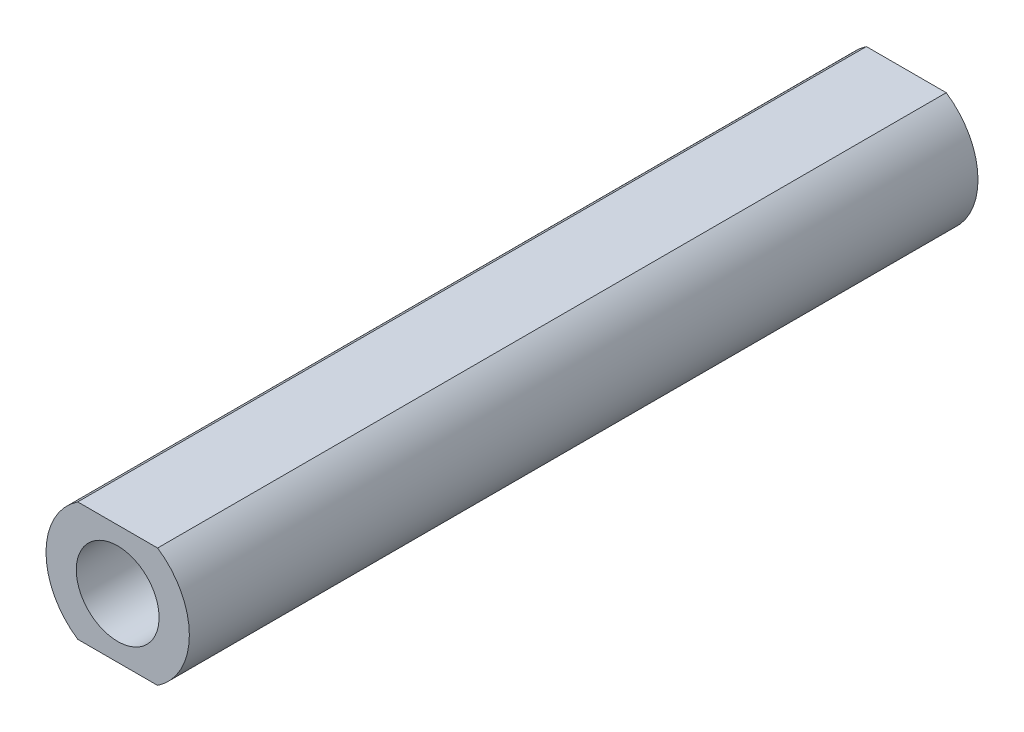
ISO-10303-21;
HEADER;
FILE_DESCRIPTION(('STEP AP214'),'2;1');
FILE_NAME('part.step','',(''),(''),'','','');
FILE_SCHEMA(('AUTOMOTIVE_DESIGN { 1 0 10303 214 1 1 1 1 }'));
ENDSEC;
DATA;
#1=APPLICATION_CONTEXT('core data for automotive mechanical design processes');
#2=APPLICATION_PROTOCOL_DEFINITION('international standard','automotive_design',2000,#1);
#3=PRODUCT_CONTEXT('',#1,'mechanical');
#4=PRODUCT('Part','Part','',(#3));
#5=PRODUCT_RELATED_PRODUCT_CATEGORY('part','',(#4));
#6=PRODUCT_DEFINITION_FORMATION('','',#4);
#7=PRODUCT_DEFINITION_CONTEXT('part definition',#1,'design');
#8=PRODUCT_DEFINITION('design','',#6,#7);
#9=PRODUCT_DEFINITION_SHAPE('','',#8);
#10=(LENGTH_UNIT() NAMED_UNIT(*) SI_UNIT(.MILLI.,.METRE.));
#11=(NAMED_UNIT(*) PLANE_ANGLE_UNIT() SI_UNIT($,.RADIAN.));
#12=(NAMED_UNIT(*) SI_UNIT($,.STERADIAN.) SOLID_ANGLE_UNIT());
#13=UNCERTAINTY_MEASURE_WITH_UNIT(LENGTH_MEASURE(1.E-05),#10,'distance_accuracy_value','');
#14=(GEOMETRIC_REPRESENTATION_CONTEXT(3) GLOBAL_UNCERTAINTY_ASSIGNED_CONTEXT((#13)) GLOBAL_UNIT_ASSIGNED_CONTEXT((#10,
#11,#12)) REPRESENTATION_CONTEXT('',''));
#15=CARTESIAN_POINT('',(0.,0.,0.));
#16=DIRECTION('',(0.,0.,1.));
#17=DIRECTION('',(1.,0.,0.));
#18=AXIS2_PLACEMENT_3D('',#15,#16,#17);
#19=CARTESIAN_POINT('',(0.,0.,76.2));
#20=DIRECTION('',(0.,0.,-1.));
#21=DIRECTION('',(-1.,0.,0.));
#22=AXIS2_PLACEMENT_3D('',#19,#20,#21);
#23=CYLINDRICAL_SURFACE('',#22,6.925);
#24=CARTESIAN_POINT('',(0.,0.,0.));
#25=DIRECTION('',(0.,0.,1.));
#26=DIRECTION('',(1.,0.,0.));
#27=AXIS2_PLACEMENT_3D('',#24,#25,#26);
#28=CIRCLE('',#27,6.925);
#29=CARTESIAN_POINT('',(-3.85916117828732,-5.75,0.));
#30=VERTEX_POINT('',#29);
#31=CARTESIAN_POINT('',(-3.85916117828732,5.75,0.));
#32=VERTEX_POINT('',#31);
#33=EDGE_CURVE('E99',#30,#32,#28,.F.);
#34=ORIENTED_EDGE('',*,*,#33,.F.);
#35=DIRECTION('',(0.,0.,-1.));
#36=VECTOR('',#35,1.);
#37=CARTESIAN_POINT('',(-3.85916117828732,-5.75,76.2));
#38=LINE('',#37,#36);
#39=CARTESIAN_POINT('',(-3.85916117828732,-5.75,76.2));
#40=VERTEX_POINT('',#39);
#41=EDGE_CURVE('E11',#40,#30,#38,.T.);
#42=ORIENTED_EDGE('',*,*,#41,.F.);
#43=CARTESIAN_POINT('',(0.,0.,76.2));
#44=DIRECTION('',(0.,0.,1.));
#45=DIRECTION('',(1.,0.,0.));
#46=AXIS2_PLACEMENT_3D('',#43,#44,#45);
#47=CIRCLE('',#46,6.925);
#48=CARTESIAN_POINT('',(-3.85916117828732,5.75,76.2));
#49=VERTEX_POINT('',#48);
#50=EDGE_CURVE('E92',#40,#49,#47,.F.);
#51=ORIENTED_EDGE('',*,*,#50,.T.);
#52=DIRECTION('',(0.,0.,-1.));
#53=VECTOR('',#52,1.);
#54=CARTESIAN_POINT('',(-3.85916117828732,5.75,76.2));
#55=LINE('',#54,#53);
#56=EDGE_CURVE('E73',#49,#32,#55,.T.);
#57=ORIENTED_EDGE('',*,*,#56,.T.);
#58=EDGE_LOOP('',(#34,#42,#51,#57));
#59=FACE_BOUND('',#58,.T.);
#60=ADVANCED_FACE('F35',(#59),#23,.T.);
#61=CARTESIAN_POINT('',(0.,-5.75,76.2));
#62=DIRECTION('',(0.,-1.,0.));
#63=DIRECTION('',(0.,0.,-1.));
#64=AXIS2_PLACEMENT_3D('',#61,#62,#63);
#65=PLANE('',#64);
#66=DIRECTION('',(-1.,0.,0.));
#67=VECTOR('',#66,1.);
#68=CARTESIAN_POINT('',(0.,-5.75,0.));
#69=LINE('',#68,#67);
#70=CARTESIAN_POINT('',(3.85916117828732,-5.75,0.));
#71=VERTEX_POINT('',#70);
#72=EDGE_CURVE('E86',#71,#30,#69,.T.);
#73=ORIENTED_EDGE('',*,*,#72,.F.);
#74=DIRECTION('',(0.,0.,-1.));
#75=VECTOR('',#74,1.);
#76=CARTESIAN_POINT('',(3.85916117828732,-5.75,76.2));
#77=LINE('',#76,#75);
#78=CARTESIAN_POINT('',(3.85916117828732,-5.75,76.2));
#79=VERTEX_POINT('',#78);
#80=EDGE_CURVE('E43',#79,#71,#77,.T.);
#81=ORIENTED_EDGE('',*,*,#80,.F.);
#82=DIRECTION('',(-1.,0.,0.));
#83=VECTOR('',#82,1.);
#84=CARTESIAN_POINT('',(0.,-5.75,76.2));
#85=LINE('',#84,#83);
#86=EDGE_CURVE('E84',#79,#40,#85,.T.);
#87=ORIENTED_EDGE('',*,*,#86,.T.);
#88=ORIENTED_EDGE('',*,*,#41,.T.);
#89=EDGE_LOOP('',(#73,#81,#87,#88));
#90=FACE_BOUND('',#89,.T.);
#91=ADVANCED_FACE('F82',(#90),#65,.T.);
#92=CARTESIAN_POINT('',(0.,0.,76.2));
#93=DIRECTION('',(0.,0.,-1.));
#94=DIRECTION('',(-1.,0.,0.));
#95=AXIS2_PLACEMENT_3D('',#92,#93,#94);
#96=CYLINDRICAL_SURFACE('',#95,6.925);
#97=CARTESIAN_POINT('',(0.,0.,0.));
#98=DIRECTION('',(0.,0.,1.));
#99=DIRECTION('',(1.,0.,0.));
#100=AXIS2_PLACEMENT_3D('',#97,#98,#99);
#101=CIRCLE('',#100,6.925);
#102=CARTESIAN_POINT('',(3.85916117828732,5.75,0.));
#103=VERTEX_POINT('',#102);
#104=EDGE_CURVE('E66',#71,#103,#101,.T.);
#105=ORIENTED_EDGE('',*,*,#104,.T.);
#106=DIRECTION('',(0.,0.,-1.));
#107=VECTOR('',#106,1.);
#108=CARTESIAN_POINT('',(3.85916117828732,5.75,76.2));
#109=LINE('',#108,#107);
#110=CARTESIAN_POINT('',(3.85916117828732,5.75,76.2));
#111=VERTEX_POINT('',#110);
#112=EDGE_CURVE('E87',#111,#103,#109,.T.);
#113=ORIENTED_EDGE('',*,*,#112,.F.);
#114=CARTESIAN_POINT('',(0.,0.,76.2));
#115=DIRECTION('',(0.,0.,1.));
#116=DIRECTION('',(1.,0.,0.));
#117=AXIS2_PLACEMENT_3D('',#114,#115,#116);
#118=CIRCLE('',#117,6.925);
#119=EDGE_CURVE('E88',#79,#111,#118,.T.);
#120=ORIENTED_EDGE('',*,*,#119,.F.);
#121=ORIENTED_EDGE('',*,*,#80,.T.);
#122=EDGE_LOOP('',(#105,#113,#120,#121));
#123=FACE_BOUND('',#122,.T.);
#124=ADVANCED_FACE('F89',(#123),#96,.T.);
#125=CARTESIAN_POINT('',(0.,5.75,76.2));
#126=DIRECTION('',(0.,-1.,0.));
#127=DIRECTION('',(0.,0.,-1.));
#128=AXIS2_PLACEMENT_3D('',#125,#126,#127);
#129=PLANE('',#128);
#130=DIRECTION('',(-1.,0.,0.));
#131=VECTOR('',#130,1.);
#132=CARTESIAN_POINT('',(0.,5.75,0.));
#133=LINE('',#132,#131);
#134=EDGE_CURVE('E94',#103,#32,#133,.T.);
#135=ORIENTED_EDGE('',*,*,#134,.T.);
#136=ORIENTED_EDGE('',*,*,#56,.F.);
#137=DIRECTION('',(-1.,0.,0.));
#138=VECTOR('',#137,1.);
#139=CARTESIAN_POINT('',(0.,5.75,76.2));
#140=LINE('',#139,#138);
#141=EDGE_CURVE('E51',#111,#49,#140,.T.);
#142=ORIENTED_EDGE('',*,*,#141,.F.);
#143=ORIENTED_EDGE('',*,*,#112,.T.);
#144=EDGE_LOOP('',(#135,#136,#142,#143));
#145=FACE_BOUND('',#144,.T.);
#146=ADVANCED_FACE('F109',(#145),#129,.F.);
#147=CARTESIAN_POINT('',(0.,0.,76.2));
#148=DIRECTION('',(0.,0.,1.));
#149=DIRECTION('',(1.,0.,0.));
#150=AXIS2_PLACEMENT_3D('',#147,#148,#149);
#151=PLANE('',#150);
#152=CARTESIAN_POINT('',(0.,0.,76.2));
#153=DIRECTION('',(0.,0.,-1.));
#154=DIRECTION('',(-1.,0.,0.));
#155=AXIS2_PLACEMENT_3D('',#152,#153,#154);
#156=CIRCLE('',#155,3.99999999999998);
#157=CARTESIAN_POINT('',(-3.99999999999998,0.,76.2));
#158=VERTEX_POINT('',#157);
#159=EDGE_CURVE('E102',#158,#158,#156,.T.);
#160=ORIENTED_EDGE('',*,*,#159,.T.);
#161=EDGE_LOOP('',(#160));
#162=FACE_BOUND('',#161,.T.);
#163=ORIENTED_EDGE('',*,*,#50,.F.);
#164=ORIENTED_EDGE('',*,*,#86,.F.);
#165=ORIENTED_EDGE('',*,*,#119,.T.);
#166=ORIENTED_EDGE('',*,*,#141,.T.);
#167=EDGE_LOOP('',(#163,#164,#165,#166));
#168=FACE_BOUND('',#167,.T.);
#169=ADVANCED_FACE('F91',(#162,#168),#151,.T.);
#170=CARTESIAN_POINT('',(0.,0.,0.));
#171=DIRECTION('',(0.,0.,1.));
#172=DIRECTION('',(1.,0.,0.));
#173=AXIS2_PLACEMENT_3D('',#170,#171,#172);
#174=PLANE('',#173);
#175=CARTESIAN_POINT('',(0.,0.,0.));
#176=DIRECTION('',(0.,0.,-1.));
#177=DIRECTION('',(-1.,0.,0.));
#178=AXIS2_PLACEMENT_3D('',#175,#176,#177);
#179=CIRCLE('',#178,3.99999999999999);
#180=CARTESIAN_POINT('',(-3.99999999999999,0.,0.));
#181=VERTEX_POINT('',#180);
#182=EDGE_CURVE('E139',#181,#181,#179,.T.);
#183=ORIENTED_EDGE('',*,*,#182,.F.);
#184=EDGE_LOOP('',(#183));
#185=FACE_BOUND('',#184,.T.);
#186=ORIENTED_EDGE('',*,*,#33,.T.);
#187=ORIENTED_EDGE('',*,*,#134,.F.);
#188=ORIENTED_EDGE('',*,*,#104,.F.);
#189=ORIENTED_EDGE('',*,*,#72,.T.);
#190=EDGE_LOOP('',(#186,#187,#188,#189));
#191=FACE_BOUND('',#190,.T.);
#192=ADVANCED_FACE('F111',(#185,#191),#174,.F.);
#193=CARTESIAN_POINT('',(0.,0.,0.));
#194=DIRECTION('',(0.,0.,-1.));
#195=DIRECTION('',(-1.,0.,0.));
#196=AXIS2_PLACEMENT_3D('',#193,#194,#195);
#197=CYLINDRICAL_SURFACE('',#196,3.99999999999999);
#198=ORIENTED_EDGE('',*,*,#159,.F.);
#199=EDGE_LOOP('',(#198));
#200=FACE_BOUND('',#199,.T.);
#201=ORIENTED_EDGE('',*,*,#182,.T.);
#202=EDGE_LOOP('',(#201));
#203=FACE_BOUND('',#202,.T.);
#204=ADVANCED_FACE('F125',(#200,#203),#197,.F.);
#205=CLOSED_SHELL('',(#60,#91,#124,#146,#169,#192,#204));
#206=MANIFOLD_SOLID_BREP('B2',#205);
#207=ADVANCED_BREP_SHAPE_REPRESENTATION('',(#18,#206),#14);
#208=SHAPE_DEFINITION_REPRESENTATION(#9,#207);
ENDSEC;
END-ISO-10303-21;
